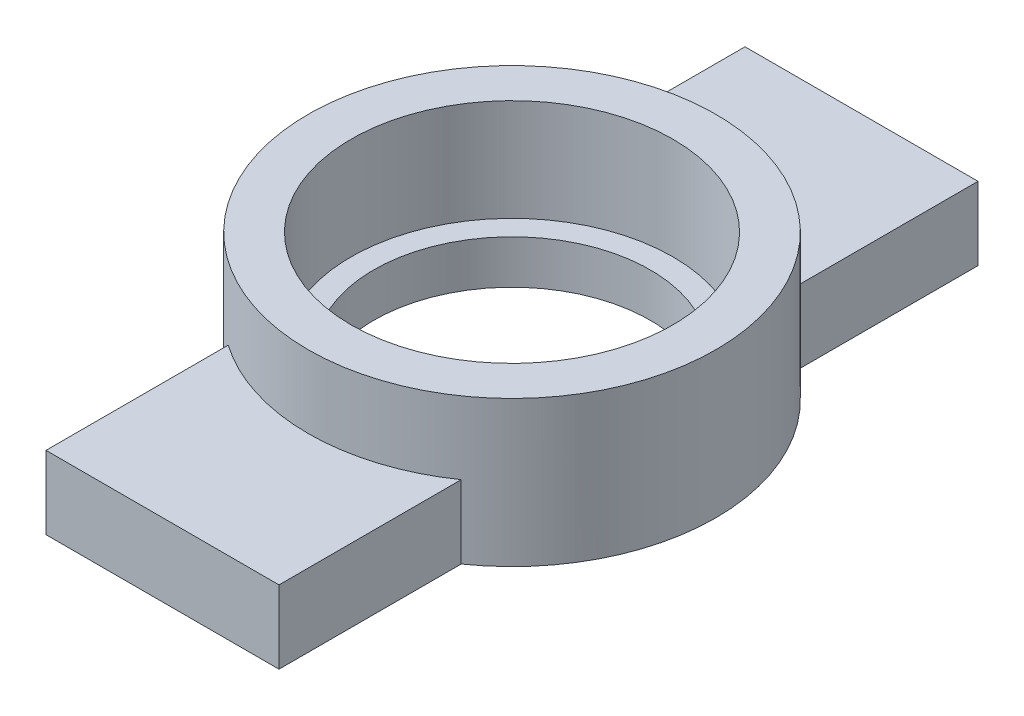
ISO-10303-21;
HEADER;
FILE_DESCRIPTION(('STEP AP214'),'2;1');
FILE_NAME('part.step','',(''),(''),'','','');
FILE_SCHEMA(('AUTOMOTIVE_DESIGN { 1 0 10303 214 1 1 1 1 }'));
ENDSEC;
DATA;
#1=APPLICATION_CONTEXT('core data for automotive mechanical design processes');
#2=APPLICATION_PROTOCOL_DEFINITION('international standard','automotive_design',2000,#1);
#3=PRODUCT_CONTEXT('',#1,'mechanical');
#4=PRODUCT('Part','Part','',(#3));
#5=PRODUCT_RELATED_PRODUCT_CATEGORY('part','',(#4));
#6=PRODUCT_DEFINITION_FORMATION('','',#4);
#7=PRODUCT_DEFINITION_CONTEXT('part definition',#1,'design');
#8=PRODUCT_DEFINITION('design','',#6,#7);
#9=PRODUCT_DEFINITION_SHAPE('','',#8);
#10=(LENGTH_UNIT() NAMED_UNIT(*) SI_UNIT(.MILLI.,.METRE.));
#11=(NAMED_UNIT(*) PLANE_ANGLE_UNIT() SI_UNIT($,.RADIAN.));
#12=(NAMED_UNIT(*) SI_UNIT($,.STERADIAN.) SOLID_ANGLE_UNIT());
#13=UNCERTAINTY_MEASURE_WITH_UNIT(LENGTH_MEASURE(1.E-05),#10,'distance_accuracy_value','');
#14=(GEOMETRIC_REPRESENTATION_CONTEXT(3) GLOBAL_UNCERTAINTY_ASSIGNED_CONTEXT((#13)) GLOBAL_UNIT_ASSIGNED_CONTEXT((#10,
#11,#12)) REPRESENTATION_CONTEXT('',''));
#15=CARTESIAN_POINT('',(0.,0.,0.));
#16=DIRECTION('',(0.,0.,1.));
#17=DIRECTION('',(1.,0.,0.));
#18=AXIS2_PLACEMENT_3D('',#15,#16,#17);
#19=CARTESIAN_POINT('',(0.,10.,0.));
#20=DIRECTION('',(0.,-1.,0.));
#21=DIRECTION('',(0.,0.,-1.));
#22=AXIS2_PLACEMENT_3D('',#19,#20,#21);
#23=CYLINDRICAL_SURFACE('',#22,14.);
#24=CARTESIAN_POINT('',(0.,10.,0.));
#25=DIRECTION('',(0.,1.,0.));
#26=DIRECTION('',(0.,0.,1.));
#27=AXIS2_PLACEMENT_3D('',#24,#25,#26);
#28=CIRCLE('',#27,14.);
#29=CARTESIAN_POINT('',(0.,10.,14.));
#30=VERTEX_POINT('',#29);
#31=EDGE_CURVE('E48',#30,#30,#28,.T.);
#32=ORIENTED_EDGE('',*,*,#31,.F.);
#33=EDGE_LOOP('',(#32));
#34=FACE_BOUND('',#33,.T.);
#35=CARTESIAN_POINT('',(0.,5.01639331206259,0.));
#36=DIRECTION('',(0.,-1.,0.));
#37=DIRECTION('',(1.,0.,0.));
#38=AXIS2_PLACEMENT_3D('',#35,#36,#37);
#39=CIRCLE('',#38,14.);
#40=CARTESIAN_POINT('',(7.99999999999999,5.01639331206259,-11.4891252930761));
#41=VERTEX_POINT('',#40);
#42=CARTESIAN_POINT('',(-8.,5.01639331206259,-11.4891252930761));
#43=VERTEX_POINT('',#42);
#44=EDGE_CURVE('E55',#41,#43,#39,.F.);
#45=ORIENTED_EDGE('',*,*,#44,.T.);
#46=DIRECTION('',(0.,-1.,0.));
#47=VECTOR('',#46,1.);
#48=CARTESIAN_POINT('',(-8.,10.,-11.4891252930761));
#49=LINE('',#48,#47);
#50=CARTESIAN_POINT('',(-8.,0.,-11.4891252930761));
#51=VERTEX_POINT('',#50);
#52=EDGE_CURVE('E117',#43,#51,#49,.T.);
#53=ORIENTED_EDGE('',*,*,#52,.T.);
#54=CARTESIAN_POINT('',(0.,0.,0.));
#55=DIRECTION('',(0.,1.,0.));
#56=DIRECTION('',(0.,0.,1.));
#57=AXIS2_PLACEMENT_3D('',#54,#55,#56);
#58=CIRCLE('',#57,14.);
#59=CARTESIAN_POINT('',(-8.,0.,11.4891252930761));
#60=VERTEX_POINT('',#59);
#61=EDGE_CURVE('E104',#51,#60,#58,.T.);
#62=ORIENTED_EDGE('',*,*,#61,.T.);
#63=DIRECTION('',(0.,-1.,0.));
#64=VECTOR('',#63,1.);
#65=CARTESIAN_POINT('',(-8.,10.,11.4891252930761));
#66=LINE('',#65,#64);
#67=CARTESIAN_POINT('',(-8.,5.01639331206259,11.4891252930761));
#68=VERTEX_POINT('',#67);
#69=EDGE_CURVE('E143',#68,#60,#66,.T.);
#70=ORIENTED_EDGE('',*,*,#69,.F.);
#71=CARTESIAN_POINT('',(0.,5.01639331206259,0.));
#72=DIRECTION('',(0.,1.,0.));
#73=DIRECTION('',(-1.,0.,0.));
#74=AXIS2_PLACEMENT_3D('',#71,#72,#73);
#75=CIRCLE('',#74,14.);
#76=CARTESIAN_POINT('',(8.,5.01639331206259,11.4891252930761));
#77=VERTEX_POINT('',#76);
#78=EDGE_CURVE('E140',#77,#68,#75,.F.);
#79=ORIENTED_EDGE('',*,*,#78,.F.);
#80=DIRECTION('',(0.,-1.,0.));
#81=VECTOR('',#80,1.);
#82=CARTESIAN_POINT('',(7.99999999999999,10.,11.4891252930761));
#83=LINE('',#82,#81);
#84=CARTESIAN_POINT('',(8.,0.,11.4891252930761));
#85=VERTEX_POINT('',#84);
#86=EDGE_CURVE('E137',#85,#77,#83,.F.);
#87=ORIENTED_EDGE('',*,*,#86,.F.);
#88=CARTESIAN_POINT('',(8.,0.,-11.4891252930761));
#89=VERTEX_POINT('',#88);
#90=EDGE_CURVE('E114',#85,#89,#58,.T.);
#91=ORIENTED_EDGE('',*,*,#90,.T.);
#92=DIRECTION('',(0.,-1.,0.));
#93=VECTOR('',#92,1.);
#94=CARTESIAN_POINT('',(7.99999999999999,10.,-11.4891252930761));
#95=LINE('',#94,#93);
#96=EDGE_CURVE('E60',#89,#41,#95,.F.);
#97=ORIENTED_EDGE('',*,*,#96,.T.);
#98=EDGE_LOOP('',(#45,#53,#62,#70,#79,#87,#91,#97));
#99=FACE_BOUND('',#98,.T.);
#100=ADVANCED_FACE('F40',(#34,#99),#23,.T.);
#101=CARTESIAN_POINT('',(0.,10.,0.));
#102=DIRECTION('',(0.,-1.,0.));
#103=DIRECTION('',(0.,0.,-1.));
#104=AXIS2_PLACEMENT_3D('',#101,#102,#103);
#105=CYLINDRICAL_SURFACE('',#104,11.05);
#106=CARTESIAN_POINT('',(0.,3.,0.));
#107=DIRECTION('',(0.,1.,0.));
#108=DIRECTION('',(0.,0.,1.));
#109=AXIS2_PLACEMENT_3D('',#106,#107,#108);
#110=CIRCLE('',#109,11.05);
#111=CARTESIAN_POINT('',(0.,3.,11.05));
#112=VERTEX_POINT('',#111);
#113=EDGE_CURVE('E12',#112,#112,#110,.T.);
#114=ORIENTED_EDGE('',*,*,#113,.F.);
#115=EDGE_LOOP('',(#114));
#116=FACE_BOUND('',#115,.T.);
#117=CARTESIAN_POINT('',(0.,10.,0.));
#118=DIRECTION('',(0.,1.,0.));
#119=DIRECTION('',(0.,0.,1.));
#120=AXIS2_PLACEMENT_3D('',#117,#118,#119);
#121=CIRCLE('',#120,11.05);
#122=CARTESIAN_POINT('',(0.,10.,11.05));
#123=VERTEX_POINT('',#122);
#124=EDGE_CURVE('E169',#123,#123,#121,.T.);
#125=ORIENTED_EDGE('',*,*,#124,.T.);
#126=EDGE_LOOP('',(#125));
#127=FACE_BOUND('',#126,.T.);
#128=ADVANCED_FACE('F42',(#116,#127),#105,.F.);
#129=CARTESIAN_POINT('',(0.,10.,0.));
#130=DIRECTION('',(0.,1.,0.));
#131=DIRECTION('',(0.,0.,1.));
#132=AXIS2_PLACEMENT_3D('',#129,#130,#131);
#133=PLANE('',#132);
#134=ORIENTED_EDGE('',*,*,#124,.F.);
#135=EDGE_LOOP('',(#134));
#136=FACE_BOUND('',#135,.T.);
#137=ORIENTED_EDGE('',*,*,#31,.T.);
#138=EDGE_LOOP('',(#137));
#139=FACE_BOUND('',#138,.T.);
#140=ADVANCED_FACE('F204',(#136,#139),#133,.T.);
#141=CARTESIAN_POINT('',(0.,0.,0.));
#142=DIRECTION('',(0.,1.,0.));
#143=DIRECTION('',(0.,0.,1.));
#144=AXIS2_PLACEMENT_3D('',#141,#142,#143);
#145=PLANE('',#144);
#146=ORIENTED_EDGE('',*,*,#90,.F.);
#147=DIRECTION('',(0.,0.,-1.));
#148=VECTOR('',#147,1.);
#149=CARTESIAN_POINT('',(8.,0.,24.));
#150=LINE('',#149,#148);
#151=CARTESIAN_POINT('',(8.,0.,24.));
#152=VERTEX_POINT('',#151);
#153=EDGE_CURVE('E160',#152,#85,#150,.T.);
#154=ORIENTED_EDGE('',*,*,#153,.F.);
#155=DIRECTION('',(1.,0.,0.));
#156=VECTOR('',#155,1.);
#157=CARTESIAN_POINT('',(-8.,0.,24.));
#158=LINE('',#157,#156);
#159=CARTESIAN_POINT('',(-8.,0.,24.));
#160=VERTEX_POINT('',#159);
#161=EDGE_CURVE('E148',#160,#152,#158,.T.);
#162=ORIENTED_EDGE('',*,*,#161,.F.);
#163=DIRECTION('',(0.,0.,-1.));
#164=VECTOR('',#163,1.);
#165=CARTESIAN_POINT('',(-8.,0.,24.));
#166=LINE('',#165,#164);
#167=EDGE_CURVE('E112',#160,#60,#166,.T.);
#168=ORIENTED_EDGE('',*,*,#167,.T.);
#169=ORIENTED_EDGE('',*,*,#61,.F.);
#170=DIRECTION('',(0.,0.,1.));
#171=VECTOR('',#170,1.);
#172=CARTESIAN_POINT('',(-8.,0.,-24.));
#173=LINE('',#172,#171);
#174=CARTESIAN_POINT('',(-8.,0.,-24.));
#175=VERTEX_POINT('',#174);
#176=EDGE_CURVE('E109',#175,#51,#173,.T.);
#177=ORIENTED_EDGE('',*,*,#176,.F.);
#178=DIRECTION('',(1.,0.,0.));
#179=VECTOR('',#178,1.);
#180=CARTESIAN_POINT('',(-8.,0.,-24.));
#181=LINE('',#180,#179);
#182=CARTESIAN_POINT('',(8.,0.,-24.));
#183=VERTEX_POINT('',#182);
#184=EDGE_CURVE('E125',#175,#183,#181,.T.);
#185=ORIENTED_EDGE('',*,*,#184,.T.);
#186=DIRECTION('',(0.,0.,1.));
#187=VECTOR('',#186,1.);
#188=CARTESIAN_POINT('',(8.,0.,-24.));
#189=LINE('',#188,#187);
#190=EDGE_CURVE('E124',#183,#89,#189,.T.);
#191=ORIENTED_EDGE('',*,*,#190,.T.);
#192=EDGE_LOOP('',(#146,#154,#162,#168,#169,#177,#185,#191));
#193=FACE_BOUND('',#192,.T.);
#194=CARTESIAN_POINT('',(0.,0.,0.));
#195=DIRECTION('',(0.,1.,0.));
#196=DIRECTION('',(0.,0.,1.));
#197=AXIS2_PLACEMENT_3D('',#194,#195,#196);
#198=CIRCLE('',#197,9.5);
#199=CARTESIAN_POINT('',(0.,0.,9.5));
#200=VERTEX_POINT('',#199);
#201=EDGE_CURVE('E164',#200,#200,#198,.T.);
#202=ORIENTED_EDGE('',*,*,#201,.T.);
#203=EDGE_LOOP('',(#202));
#204=FACE_BOUND('',#203,.T.);
#205=ADVANCED_FACE('F105',(#193,#204),#145,.F.);
#206=CARTESIAN_POINT('',(0.,3.,0.));
#207=DIRECTION('',(0.,1.,0.));
#208=DIRECTION('',(0.,0.,1.));
#209=AXIS2_PLACEMENT_3D('',#206,#207,#208);
#210=PLANE('',#209);
#211=ORIENTED_EDGE('',*,*,#113,.T.);
#212=EDGE_LOOP('',(#211));
#213=FACE_BOUND('',#212,.T.);
#214=CARTESIAN_POINT('',(0.,3.,0.));
#215=DIRECTION('',(0.,1.,0.));
#216=DIRECTION('',(0.,0.,1.));
#217=AXIS2_PLACEMENT_3D('',#214,#215,#216);
#218=CIRCLE('',#217,9.5);
#219=CARTESIAN_POINT('',(0.,3.,9.5));
#220=VERTEX_POINT('',#219);
#221=EDGE_CURVE('E115',#220,#220,#218,.T.);
#222=ORIENTED_EDGE('',*,*,#221,.F.);
#223=EDGE_LOOP('',(#222));
#224=FACE_BOUND('',#223,.T.);
#225=ADVANCED_FACE('F210',(#213,#224),#210,.T.);
#226=CARTESIAN_POINT('',(0.,3.,0.));
#227=DIRECTION('',(0.,-1.,0.));
#228=DIRECTION('',(0.,0.,-1.));
#229=AXIS2_PLACEMENT_3D('',#226,#227,#228);
#230=CYLINDRICAL_SURFACE('',#229,9.5);
#231=ORIENTED_EDGE('',*,*,#221,.T.);
#232=EDGE_LOOP('',(#231));
#233=FACE_BOUND('',#232,.T.);
#234=ORIENTED_EDGE('',*,*,#201,.F.);
#235=EDGE_LOOP('',(#234));
#236=FACE_BOUND('',#235,.T.);
#237=ADVANCED_FACE('F216',(#233,#236),#230,.F.);
#238=CARTESIAN_POINT('',(-8.,0.,24.));
#239=DIRECTION('',(1.,0.,0.));
#240=DIRECTION('',(0.,0.,-1.));
#241=AXIS2_PLACEMENT_3D('',#238,#239,#240);
#242=PLANE('',#241);
#243=DIRECTION('',(0.,0.,-1.));
#244=VECTOR('',#243,1.);
#245=CARTESIAN_POINT('',(-8.,5.01639331206259,24.));
#246=LINE('',#245,#244);
#247=CARTESIAN_POINT('',(-8.,5.01639331206259,24.));
#248=VERTEX_POINT('',#247);
#249=EDGE_CURVE('E154',#248,#68,#246,.T.);
#250=ORIENTED_EDGE('',*,*,#249,.T.);
#251=ORIENTED_EDGE('',*,*,#69,.T.);
#252=ORIENTED_EDGE('',*,*,#167,.F.);
#253=DIRECTION('',(0.,-1.,0.));
#254=VECTOR('',#253,1.);
#255=CARTESIAN_POINT('',(-8.,0.,24.));
#256=LINE('',#255,#254);
#257=EDGE_CURVE('E145',#248,#160,#256,.T.);
#258=ORIENTED_EDGE('',*,*,#257,.F.);
#259=EDGE_LOOP('',(#250,#251,#252,#258));
#260=FACE_BOUND('',#259,.T.);
#261=ADVANCED_FACE('F220',(#260),#242,.F.);
#262=CARTESIAN_POINT('',(8.,0.,24.));
#263=DIRECTION('',(-1.,0.,0.));
#264=DIRECTION('',(0.,-1.,0.));
#265=AXIS2_PLACEMENT_3D('',#262,#263,#264);
#266=PLANE('',#265);
#267=ORIENTED_EDGE('',*,*,#153,.T.);
#268=ORIENTED_EDGE('',*,*,#86,.T.);
#269=DIRECTION('',(0.,0.,-1.));
#270=VECTOR('',#269,1.);
#271=CARTESIAN_POINT('',(8.,5.01639331206259,24.));
#272=LINE('',#271,#270);
#273=CARTESIAN_POINT('',(8.,5.01639331206259,24.));
#274=VERTEX_POINT('',#273);
#275=EDGE_CURVE('E157',#274,#77,#272,.T.);
#276=ORIENTED_EDGE('',*,*,#275,.F.);
#277=DIRECTION('',(0.,1.,0.));
#278=VECTOR('',#277,1.);
#279=CARTESIAN_POINT('',(8.,0.,24.));
#280=LINE('',#279,#278);
#281=EDGE_CURVE('E150',#152,#274,#280,.T.);
#282=ORIENTED_EDGE('',*,*,#281,.F.);
#283=EDGE_LOOP('',(#267,#268,#276,#282));
#284=FACE_BOUND('',#283,.T.);
#285=ADVANCED_FACE('F224',(#284),#266,.F.);
#286=CARTESIAN_POINT('',(-8.,5.01639331206259,24.));
#287=DIRECTION('',(0.,-1.,0.));
#288=DIRECTION('',(1.,0.,0.));
#289=AXIS2_PLACEMENT_3D('',#286,#287,#288);
#290=PLANE('',#289);
#291=ORIENTED_EDGE('',*,*,#275,.T.);
#292=ORIENTED_EDGE('',*,*,#78,.T.);
#293=ORIENTED_EDGE('',*,*,#249,.F.);
#294=DIRECTION('',(-1.,0.,0.));
#295=VECTOR('',#294,1.);
#296=CARTESIAN_POINT('',(-8.,5.01639331206259,24.));
#297=LINE('',#296,#295);
#298=EDGE_CURVE('E152',#274,#248,#297,.T.);
#299=ORIENTED_EDGE('',*,*,#298,.F.);
#300=EDGE_LOOP('',(#291,#292,#293,#299));
#301=FACE_BOUND('',#300,.T.);
#302=ADVANCED_FACE('F228',(#301),#290,.F.);
#303=CARTESIAN_POINT('',(0.,0.,24.));
#304=DIRECTION('',(0.,0.,-1.));
#305=DIRECTION('',(-1.,0.,0.));
#306=AXIS2_PLACEMENT_3D('',#303,#304,#305);
#307=PLANE('',#306);
#308=ORIENTED_EDGE('',*,*,#257,.T.);
#309=ORIENTED_EDGE('',*,*,#161,.T.);
#310=ORIENTED_EDGE('',*,*,#281,.T.);
#311=ORIENTED_EDGE('',*,*,#298,.T.);
#312=EDGE_LOOP('',(#308,#309,#310,#311));
#313=FACE_BOUND('',#312,.T.);
#314=ADVANCED_FACE('F197',(#313),#307,.F.);
#315=CARTESIAN_POINT('',(-8.,0.,-24.));
#316=DIRECTION('',(-1.,0.,0.));
#317=DIRECTION('',(0.,0.,1.));
#318=AXIS2_PLACEMENT_3D('',#315,#316,#317);
#319=PLANE('',#318);
#320=ORIENTED_EDGE('',*,*,#176,.T.);
#321=ORIENTED_EDGE('',*,*,#52,.F.);
#322=DIRECTION('',(0.,0.,1.));
#323=VECTOR('',#322,1.);
#324=CARTESIAN_POINT('',(-8.,5.01639331206259,-24.));
#325=LINE('',#324,#323);
#326=CARTESIAN_POINT('',(-8.,5.01639331206259,-24.));
#327=VERTEX_POINT('',#326);
#328=EDGE_CURVE('E135',#327,#43,#325,.T.);
#329=ORIENTED_EDGE('',*,*,#328,.F.);
#330=DIRECTION('',(0.,-1.,0.));
#331=VECTOR('',#330,1.);
#332=CARTESIAN_POINT('',(-8.,0.,-24.));
#333=LINE('',#332,#331);
#334=EDGE_CURVE('E122',#327,#175,#333,.T.);
#335=ORIENTED_EDGE('',*,*,#334,.T.);
#336=EDGE_LOOP('',(#320,#321,#329,#335));
#337=FACE_BOUND('',#336,.T.);
#338=ADVANCED_FACE('F120',(#337),#319,.T.);
#339=CARTESIAN_POINT('',(-8.,5.01639331206259,-24.));
#340=DIRECTION('',(0.,1.,0.));
#341=DIRECTION('',(-1.,0.,0.));
#342=AXIS2_PLACEMENT_3D('',#339,#340,#341);
#343=PLANE('',#342);
#344=ORIENTED_EDGE('',*,*,#328,.T.);
#345=ORIENTED_EDGE('',*,*,#44,.F.);
#346=DIRECTION('',(0.,0.,1.));
#347=VECTOR('',#346,1.);
#348=CARTESIAN_POINT('',(8.,5.01639331206259,-24.));
#349=LINE('',#348,#347);
#350=CARTESIAN_POINT('',(8.,5.01639331206259,-24.));
#351=VERTEX_POINT('',#350);
#352=EDGE_CURVE('E128',#351,#41,#349,.T.);
#353=ORIENTED_EDGE('',*,*,#352,.F.);
#354=DIRECTION('',(-1.,0.,0.));
#355=VECTOR('',#354,1.);
#356=CARTESIAN_POINT('',(-8.,5.01639331206259,-24.));
#357=LINE('',#356,#355);
#358=EDGE_CURVE('E183',#351,#327,#357,.T.);
#359=ORIENTED_EDGE('',*,*,#358,.T.);
#360=EDGE_LOOP('',(#344,#345,#353,#359));
#361=FACE_BOUND('',#360,.T.);
#362=ADVANCED_FACE('F189',(#361),#343,.T.);
#363=CARTESIAN_POINT('',(8.,0.,-24.));
#364=DIRECTION('',(1.,0.,0.));
#365=DIRECTION('',(0.,1.,0.));
#366=AXIS2_PLACEMENT_3D('',#363,#364,#365);
#367=PLANE('',#366);
#368=ORIENTED_EDGE('',*,*,#352,.T.);
#369=ORIENTED_EDGE('',*,*,#96,.F.);
#370=ORIENTED_EDGE('',*,*,#190,.F.);
#371=DIRECTION('',(0.,1.,0.));
#372=VECTOR('',#371,1.);
#373=CARTESIAN_POINT('',(8.,0.,-24.));
#374=LINE('',#373,#372);
#375=EDGE_CURVE('E130',#183,#351,#374,.T.);
#376=ORIENTED_EDGE('',*,*,#375,.T.);
#377=EDGE_LOOP('',(#368,#369,#370,#376));
#378=FACE_BOUND('',#377,.T.);
#379=ADVANCED_FACE('F178',(#378),#367,.T.);
#380=CARTESIAN_POINT('',(0.,0.,-24.));
#381=DIRECTION('',(0.,0.,1.));
#382=DIRECTION('',(-1.,0.,0.));
#383=AXIS2_PLACEMENT_3D('',#380,#381,#382);
#384=PLANE('',#383);
#385=ORIENTED_EDGE('',*,*,#334,.F.);
#386=ORIENTED_EDGE('',*,*,#358,.F.);
#387=ORIENTED_EDGE('',*,*,#375,.F.);
#388=ORIENTED_EDGE('',*,*,#184,.F.);
#389=EDGE_LOOP('',(#385,#386,#387,#388));
#390=FACE_BOUND('',#389,.T.);
#391=ADVANCED_FACE('F187',(#390),#384,.F.);
#392=CLOSED_SHELL('',(#100,#128,#140,#205,#225,#237,#261,#285,#302,#314,#338,#362,#379,#391));
#393=MANIFOLD_SOLID_BREP('B2',#392);
#394=ADVANCED_BREP_SHAPE_REPRESENTATION('',(#18,#393),#14);
#395=SHAPE_DEFINITION_REPRESENTATION(#9,#394);
ENDSEC;
END-ISO-10303-21;
